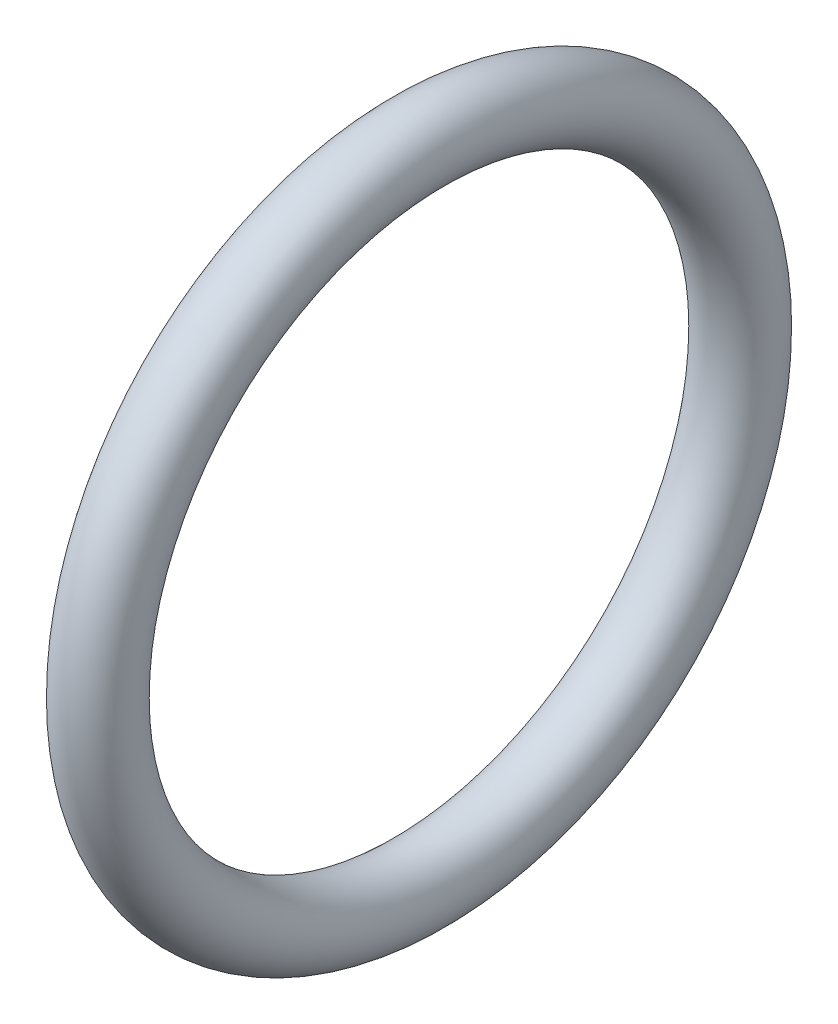
ISO-10303-21;
HEADER;
FILE_DESCRIPTION(('STEP AP214'),'2;1');
FILE_NAME('part.step','',(''),(''),'','','');
FILE_SCHEMA(('AUTOMOTIVE_DESIGN { 1 0 10303 214 1 1 1 1 }'));
ENDSEC;
DATA;
#1=APPLICATION_CONTEXT('core data for automotive mechanical design processes');
#2=APPLICATION_PROTOCOL_DEFINITION('international standard','automotive_design',2000,#1);
#3=PRODUCT_CONTEXT('',#1,'mechanical');
#4=PRODUCT('Part','Part','',(#3));
#5=PRODUCT_RELATED_PRODUCT_CATEGORY('part','',(#4));
#6=PRODUCT_DEFINITION_FORMATION('','',#4);
#7=PRODUCT_DEFINITION_CONTEXT('part definition',#1,'design');
#8=PRODUCT_DEFINITION('design','',#6,#7);
#9=PRODUCT_DEFINITION_SHAPE('','',#8);
#10=(LENGTH_UNIT() NAMED_UNIT(*) SI_UNIT(.MILLI.,.METRE.));
#11=(NAMED_UNIT(*) PLANE_ANGLE_UNIT() SI_UNIT($,.RADIAN.));
#12=(NAMED_UNIT(*) SI_UNIT($,.STERADIAN.) SOLID_ANGLE_UNIT());
#13=UNCERTAINTY_MEASURE_WITH_UNIT(LENGTH_MEASURE(1.E-05),#10,'distance_accuracy_value','');
#14=(GEOMETRIC_REPRESENTATION_CONTEXT(3) GLOBAL_UNCERTAINTY_ASSIGNED_CONTEXT((#13)) GLOBAL_UNIT_ASSIGNED_CONTEXT((#10,
#11,#12)) REPRESENTATION_CONTEXT('',''));
#15=CARTESIAN_POINT('',(0.,0.,0.));
#16=DIRECTION('',(0.,0.,1.));
#17=DIRECTION('',(1.,0.,0.));
#18=AXIS2_PLACEMENT_3D('',#15,#16,#17);
#19=CARTESIAN_POINT('',(2.54,0.,0.));
#20=DIRECTION('',(-1.,0.,0.));
#21=DIRECTION('',(0.,0.,1.));
#22=AXIS2_PLACEMENT_3D('',#19,#20,#21);
#23=TOROIDAL_SURFACE('',#22,6.731,0.762);
#24=CARTESIAN_POINT('',(2.54,0.,7.493));
#25=VERTEX_POINT('',#24);
#26=VERTEX_LOOP('',#25);
#27=FACE_BOUND('',#26,.T.);
#28=ADVANCED_FACE('F27',(#27),#23,.T.);
#29=CLOSED_SHELL('',(#28));
#30=MANIFOLD_SOLID_BREP('B2',#29);
#31=ADVANCED_BREP_SHAPE_REPRESENTATION('',(#18,#30),#14);
#32=SHAPE_DEFINITION_REPRESENTATION(#9,#31);
ENDSEC;
END-ISO-10303-21;
